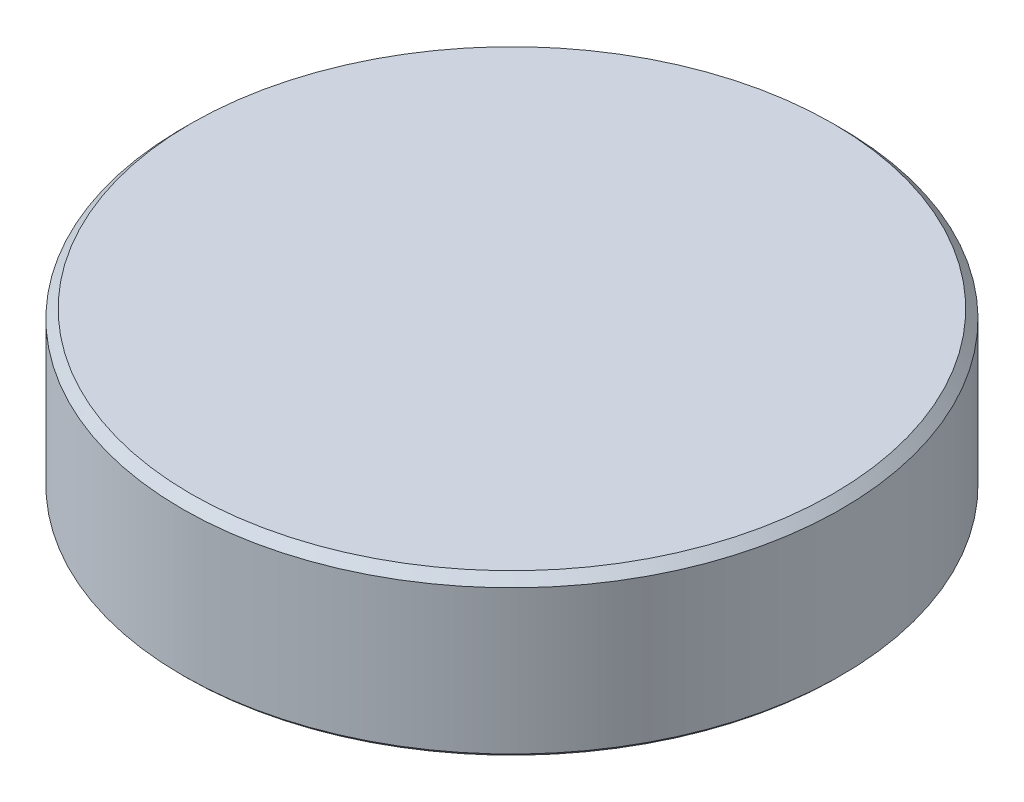
ISO-10303-21;
HEADER;
FILE_DESCRIPTION(('STEP AP214'),'2;1');
FILE_NAME('part.step','',(''),(''),'','','');
FILE_SCHEMA(('AUTOMOTIVE_DESIGN { 1 0 10303 214 1 1 1 1 }'));
ENDSEC;
DATA;
#1=APPLICATION_CONTEXT('core data for automotive mechanical design processes');
#2=APPLICATION_PROTOCOL_DEFINITION('international standard','automotive_design',2000,#1);
#3=PRODUCT_CONTEXT('',#1,'mechanical');
#4=PRODUCT('Part','Part','',(#3));
#5=PRODUCT_RELATED_PRODUCT_CATEGORY('part','',(#4));
#6=PRODUCT_DEFINITION_FORMATION('','',#4);
#7=PRODUCT_DEFINITION_CONTEXT('part definition',#1,'design');
#8=PRODUCT_DEFINITION('design','',#6,#7);
#9=PRODUCT_DEFINITION_SHAPE('','',#8);
#10=(LENGTH_UNIT() NAMED_UNIT(*) SI_UNIT(.MILLI.,.METRE.));
#11=(NAMED_UNIT(*) PLANE_ANGLE_UNIT() SI_UNIT($,.RADIAN.));
#12=(NAMED_UNIT(*) SI_UNIT($,.STERADIAN.) SOLID_ANGLE_UNIT());
#13=UNCERTAINTY_MEASURE_WITH_UNIT(LENGTH_MEASURE(1.E-05),#10,'distance_accuracy_value','');
#14=(GEOMETRIC_REPRESENTATION_CONTEXT(3) GLOBAL_UNCERTAINTY_ASSIGNED_CONTEXT((#13)) GLOBAL_UNIT_ASSIGNED_CONTEXT((#10,
#11,#12)) REPRESENTATION_CONTEXT('',''));
#15=CARTESIAN_POINT('',(0.,0.,0.));
#16=DIRECTION('',(0.,0.,1.));
#17=DIRECTION('',(1.,0.,0.));
#18=AXIS2_PLACEMENT_3D('',#15,#16,#17);
#19=CARTESIAN_POINT('',(0.,0.,0.));
#20=DIRECTION('',(0.,1.,0.));
#21=DIRECTION('',(0.,0.,1.));
#22=AXIS2_PLACEMENT_3D('',#19,#20,#21);
#23=PLANE('',#22);
#24=CARTESIAN_POINT('',(0.,0.,0.));
#25=DIRECTION('',(0.,1.,0.));
#26=DIRECTION('',(0.,0.,1.));
#27=AXIS2_PLACEMENT_3D('',#24,#25,#26);
#28=CIRCLE('',#27,36.4);
#29=CARTESIAN_POINT('',(0.,0.,36.4));
#30=VERTEX_POINT('',#29);
#31=EDGE_CURVE('E76',#30,#30,#28,.T.);
#32=ORIENTED_EDGE('',*,*,#31,.T.);
#33=EDGE_LOOP('',(#32));
#34=FACE_BOUND('',#33,.T.);
#35=CARTESIAN_POINT('',(0.,0.,0.));
#36=DIRECTION('',(0.,1.,0.));
#37=DIRECTION('',(0.,0.,1.));
#38=AXIS2_PLACEMENT_3D('',#35,#36,#37);
#39=CIRCLE('',#38,37.6);
#40=CARTESIAN_POINT('',(0.,0.,37.6));
#41=VERTEX_POINT('',#40);
#42=EDGE_CURVE('E79',#41,#41,#39,.F.);
#43=ORIENTED_EDGE('',*,*,#42,.T.);
#44=EDGE_LOOP('',(#43));
#45=FACE_BOUND('',#44,.T.);
#46=ADVANCED_FACE('F39',(#34,#45),#23,.F.);
#47=CARTESIAN_POINT('',(0.,16.,0.));
#48=DIRECTION('',(0.,-1.,0.));
#49=DIRECTION('',(0.,0.,-1.));
#50=AXIS2_PLACEMENT_3D('',#47,#48,#49);
#51=CYLINDRICAL_SURFACE('',#50,38.);
#52=CARTESIAN_POINT('',(0.,17.,0.));
#53=DIRECTION('',(0.,1.,0.));
#54=DIRECTION('',(0.,0.,1.));
#55=AXIS2_PLACEMENT_3D('',#52,#53,#54);
#56=CIRCLE('',#55,38.);
#57=CARTESIAN_POINT('',(0.,17.,38.));
#58=VERTEX_POINT('',#57);
#59=EDGE_CURVE('E10',#58,#58,#56,.F.);
#60=ORIENTED_EDGE('',*,*,#59,.T.);
#61=EDGE_LOOP('',(#60));
#62=FACE_BOUND('',#61,.T.);
#63=CARTESIAN_POINT('',(0.,0.399999999999998,0.));
#64=DIRECTION('',(0.,1.,0.));
#65=DIRECTION('',(0.,0.,1.));
#66=AXIS2_PLACEMENT_3D('',#63,#64,#65);
#67=CIRCLE('',#66,38.);
#68=CARTESIAN_POINT('',(0.,0.399999999999998,38.));
#69=VERTEX_POINT('',#68);
#70=EDGE_CURVE('E73',#69,#69,#67,.T.);
#71=ORIENTED_EDGE('',*,*,#70,.T.);
#72=EDGE_LOOP('',(#71));
#73=FACE_BOUND('',#72,.T.);
#74=ADVANCED_FACE('F112',(#62,#73),#51,.T.);
#75=CARTESIAN_POINT('',(0.,16.,0.));
#76=DIRECTION('',(0.,-1.,0.));
#77=DIRECTION('',(0.,0.,-1.));
#78=AXIS2_PLACEMENT_3D('',#75,#76,#77);
#79=CYLINDRICAL_SURFACE('',#78,36.);
#80=CARTESIAN_POINT('',(0.,15.6,0.));
#81=DIRECTION('',(0.,1.,0.));
#82=DIRECTION('',(0.,0.,1.));
#83=AXIS2_PLACEMENT_3D('',#80,#81,#82);
#84=CIRCLE('',#83,36.);
#85=CARTESIAN_POINT('',(0.,15.6,36.));
#86=VERTEX_POINT('',#85);
#87=EDGE_CURVE('E85',#86,#86,#84,.T.);
#88=ORIENTED_EDGE('',*,*,#87,.T.);
#89=EDGE_LOOP('',(#88));
#90=FACE_BOUND('',#89,.T.);
#91=CARTESIAN_POINT('',(0.,0.399999999999991,0.));
#92=DIRECTION('',(0.,1.,0.));
#93=DIRECTION('',(0.,0.,1.));
#94=AXIS2_PLACEMENT_3D('',#91,#92,#93);
#95=CIRCLE('',#94,36.);
#96=CARTESIAN_POINT('',(0.,0.399999999999991,36.));
#97=VERTEX_POINT('',#96);
#98=EDGE_CURVE('E88',#97,#97,#95,.F.);
#99=ORIENTED_EDGE('',*,*,#98,.T.);
#100=EDGE_LOOP('',(#99));
#101=FACE_BOUND('',#100,.T.);
#102=ADVANCED_FACE('F119',(#90,#101),#79,.F.);
#103=CARTESIAN_POINT('',(0.,16.,0.));
#104=DIRECTION('',(0.,1.,0.));
#105=DIRECTION('',(0.,0.,1.));
#106=AXIS2_PLACEMENT_3D('',#103,#104,#105);
#107=PLANE('',#106);
#108=CARTESIAN_POINT('',(0.,16.,0.));
#109=DIRECTION('',(0.,1.,0.));
#110=DIRECTION('',(0.,0.,1.));
#111=AXIS2_PLACEMENT_3D('',#108,#109,#110);
#112=CIRCLE('',#111,5.39999999999997);
#113=CARTESIAN_POINT('',(0.,16.,5.39999999999997));
#114=VERTEX_POINT('',#113);
#115=EDGE_CURVE('E63',#114,#114,#112,.T.);
#116=ORIENTED_EDGE('',*,*,#115,.T.);
#117=EDGE_LOOP('',(#116));
#118=FACE_BOUND('',#117,.T.);
#119=CARTESIAN_POINT('',(0.,16.,0.));
#120=DIRECTION('',(0.,1.,0.));
#121=DIRECTION('',(0.,0.,1.));
#122=AXIS2_PLACEMENT_3D('',#119,#120,#121);
#123=CIRCLE('',#122,35.6);
#124=CARTESIAN_POINT('',(0.,16.,35.6));
#125=VERTEX_POINT('',#124);
#126=EDGE_CURVE('E82',#125,#125,#123,.F.);
#127=ORIENTED_EDGE('',*,*,#126,.T.);
#128=EDGE_LOOP('',(#127));
#129=FACE_BOUND('',#128,.T.);
#130=ADVANCED_FACE('F206',(#118,#129),#107,.F.);
#131=CARTESIAN_POINT('',(0.,18.,0.));
#132=DIRECTION('',(0.,1.,0.));
#133=DIRECTION('',(0.,0.,1.));
#134=AXIS2_PLACEMENT_3D('',#131,#132,#133);
#135=PLANE('',#134);
#136=CARTESIAN_POINT('',(0.,18.,0.));
#137=DIRECTION('',(0.,1.,0.));
#138=DIRECTION('',(0.,0.,1.));
#139=AXIS2_PLACEMENT_3D('',#136,#137,#138);
#140=CIRCLE('',#139,37.);
#141=CARTESIAN_POINT('',(0.,18.,37.));
#142=VERTEX_POINT('',#141);
#143=EDGE_CURVE('E47',#142,#142,#140,.T.);
#144=ORIENTED_EDGE('',*,*,#143,.T.);
#145=EDGE_LOOP('',(#144));
#146=FACE_BOUND('',#145,.T.);
#147=ADVANCED_FACE('F133',(#146),#135,.T.);
#148=CARTESIAN_POINT('',(0.,15.6,0.));
#149=DIRECTION('',(0.,-1.,0.));
#150=DIRECTION('',(0.,0.,-1.));
#151=AXIS2_PLACEMENT_3D('',#148,#149,#150);
#152=CONICAL_SURFACE('',#151,36.,0.785398163397448);
#153=ORIENTED_EDGE('',*,*,#126,.F.);
#154=EDGE_LOOP('',(#153));
#155=FACE_BOUND('',#154,.T.);
#156=ORIENTED_EDGE('',*,*,#87,.F.);
#157=EDGE_LOOP('',(#156));
#158=FACE_BOUND('',#157,.T.);
#159=ADVANCED_FACE('F126',(#155,#158),#152,.F.);
#160=CARTESIAN_POINT('',(0.,0.,0.));
#161=DIRECTION('',(0.,-1.,0.));
#162=DIRECTION('',(0.,0.,-1.));
#163=AXIS2_PLACEMENT_3D('',#160,#161,#162);
#164=CONICAL_SURFACE('',#163,36.4,0.785398163397448);
#165=ORIENTED_EDGE('',*,*,#98,.F.);
#166=EDGE_LOOP('',(#165));
#167=FACE_BOUND('',#166,.T.);
#168=ORIENTED_EDGE('',*,*,#31,.F.);
#169=EDGE_LOOP('',(#168));
#170=FACE_BOUND('',#169,.T.);
#171=ADVANCED_FACE('F132',(#167,#170),#164,.F.);
#172=CARTESIAN_POINT('',(0.,0.399999999999998,0.));
#173=DIRECTION('',(0.,1.,0.));
#174=DIRECTION('',(0.,0.,1.));
#175=AXIS2_PLACEMENT_3D('',#172,#173,#174);
#176=CONICAL_SURFACE('',#175,38.,0.785398163397457);
#177=ORIENTED_EDGE('',*,*,#42,.F.);
#178=EDGE_LOOP('',(#177));
#179=FACE_BOUND('',#178,.T.);
#180=ORIENTED_EDGE('',*,*,#70,.F.);
#181=EDGE_LOOP('',(#180));
#182=FACE_BOUND('',#181,.T.);
#183=ADVANCED_FACE('F108',(#179,#182),#176,.T.);
#184=CARTESIAN_POINT('',(0.,14.,0.));
#185=DIRECTION('',(0.,1.,0.));
#186=DIRECTION('',(0.,0.,1.));
#187=AXIS2_PLACEMENT_3D('',#184,#185,#186);
#188=CYLINDRICAL_SURFACE('',#187,5.);
#189=CARTESIAN_POINT('',(0.,15.6,0.));
#190=DIRECTION('',(0.,1.,0.));
#191=DIRECTION('',(0.,0.,1.));
#192=AXIS2_PLACEMENT_3D('',#189,#190,#191);
#193=CIRCLE('',#192,5.);
#194=CARTESIAN_POINT('',(0.,15.6,5.));
#195=VERTEX_POINT('',#194);
#196=EDGE_CURVE('E66',#195,#195,#193,.F.);
#197=ORIENTED_EDGE('',*,*,#196,.T.);
#198=EDGE_LOOP('',(#197));
#199=FACE_BOUND('',#198,.T.);
#200=CARTESIAN_POINT('',(0.,14.4,0.));
#201=DIRECTION('',(0.,-1.,0.));
#202=DIRECTION('',(0.,0.,-1.));
#203=AXIS2_PLACEMENT_3D('',#200,#201,#202);
#204=CIRCLE('',#203,5.);
#205=CARTESIAN_POINT('',(0.,14.4,-5.));
#206=VERTEX_POINT('',#205);
#207=EDGE_CURVE('E69',#206,#206,#204,.F.);
#208=ORIENTED_EDGE('',*,*,#207,.T.);
#209=EDGE_LOOP('',(#208));
#210=FACE_BOUND('',#209,.T.);
#211=ADVANCED_FACE('F98',(#199,#210),#188,.T.);
#212=CARTESIAN_POINT('',(0.,14.,0.));
#213=DIRECTION('',(0.,-1.,0.));
#214=DIRECTION('',(0.,0.,-1.));
#215=AXIS2_PLACEMENT_3D('',#212,#213,#214);
#216=PLANE('',#215);
#217=CARTESIAN_POINT('',(0.,14.,0.));
#218=DIRECTION('',(0.,-1.,0.));
#219=DIRECTION('',(0.,0.,-1.));
#220=AXIS2_PLACEMENT_3D('',#217,#218,#219);
#221=CIRCLE('',#220,4.60000000000002);
#222=CARTESIAN_POINT('',(0.,14.,-4.60000000000002));
#223=VERTEX_POINT('',#222);
#224=EDGE_CURVE('E60',#223,#223,#221,.T.);
#225=ORIENTED_EDGE('',*,*,#224,.T.);
#226=EDGE_LOOP('',(#225));
#227=FACE_BOUND('',#226,.T.);
#228=CARTESIAN_POINT('',(0.,14.,0.));
#229=DIRECTION('',(0.,-1.,0.));
#230=DIRECTION('',(0.,0.,-1.));
#231=AXIS2_PLACEMENT_3D('',#228,#229,#230);
#232=CIRCLE('',#231,3.);
#233=CARTESIAN_POINT('',(0.,14.,-3.));
#234=VERTEX_POINT('',#233);
#235=EDGE_CURVE('E72',#234,#234,#232,.T.);
#236=ORIENTED_EDGE('',*,*,#235,.F.);
#237=EDGE_LOOP('',(#236));
#238=FACE_BOUND('',#237,.T.);
#239=ADVANCED_FACE('F96',(#227,#238),#216,.T.);
#240=CARTESIAN_POINT('',(0.,7.,0.));
#241=DIRECTION('',(0.,1.,0.));
#242=DIRECTION('',(0.,0.,1.));
#243=AXIS2_PLACEMENT_3D('',#240,#241,#242);
#244=CYLINDRICAL_SURFACE('',#243,3.);
#245=CARTESIAN_POINT('',(0.,7.40000000000002,0.));
#246=DIRECTION('',(0.,-1.,0.));
#247=DIRECTION('',(0.,0.,-1.));
#248=AXIS2_PLACEMENT_3D('',#245,#246,#247);
#249=CIRCLE('',#248,3.);
#250=CARTESIAN_POINT('',(0.,7.40000000000002,-3.));
#251=VERTEX_POINT('',#250);
#252=EDGE_CURVE('E51',#251,#251,#249,.F.);
#253=ORIENTED_EDGE('',*,*,#252,.T.);
#254=EDGE_LOOP('',(#253));
#255=FACE_BOUND('',#254,.T.);
#256=ORIENTED_EDGE('',*,*,#235,.T.);
#257=EDGE_LOOP('',(#256));
#258=FACE_BOUND('',#257,.T.);
#259=ADVANCED_FACE('F94',(#255,#258),#244,.T.);
#260=CARTESIAN_POINT('',(0.,7.,0.));
#261=DIRECTION('',(0.,-1.,0.));
#262=DIRECTION('',(0.,0.,-1.));
#263=AXIS2_PLACEMENT_3D('',#260,#261,#262);
#264=PLANE('',#263);
#265=CARTESIAN_POINT('',(0.,7.,0.));
#266=DIRECTION('',(0.,-1.,0.));
#267=DIRECTION('',(0.,0.,-1.));
#268=AXIS2_PLACEMENT_3D('',#265,#266,#267);
#269=CIRCLE('',#268,2.59999999999998);
#270=CARTESIAN_POINT('',(0.,7.,-2.59999999999998));
#271=VERTEX_POINT('',#270);
#272=EDGE_CURVE('E55',#271,#271,#269,.T.);
#273=ORIENTED_EDGE('',*,*,#272,.T.);
#274=EDGE_LOOP('',(#273));
#275=FACE_BOUND('',#274,.T.);
#276=ADVANCED_FACE('F105',(#275),#264,.T.);
#277=CARTESIAN_POINT('',(0.,15.6,0.));
#278=DIRECTION('',(0.,1.,0.));
#279=DIRECTION('',(0.,0.,1.));
#280=AXIS2_PLACEMENT_3D('',#277,#278,#279);
#281=CONICAL_SURFACE('',#280,5.,0.785398163397436);
#282=ORIENTED_EDGE('',*,*,#115,.F.);
#283=EDGE_LOOP('',(#282));
#284=FACE_BOUND('',#283,.T.);
#285=ORIENTED_EDGE('',*,*,#196,.F.);
#286=EDGE_LOOP('',(#285));
#287=FACE_BOUND('',#286,.T.);
#288=ADVANCED_FACE('F147',(#284,#287),#281,.T.);
#289=CARTESIAN_POINT('',(0.,14.,0.));
#290=DIRECTION('',(0.,1.,0.));
#291=DIRECTION('',(0.,0.,1.));
#292=AXIS2_PLACEMENT_3D('',#289,#290,#291);
#293=CONICAL_SURFACE('',#292,4.60000000000002,0.785398163397432);
#294=ORIENTED_EDGE('',*,*,#207,.F.);
#295=EDGE_LOOP('',(#294));
#296=FACE_BOUND('',#295,.T.);
#297=ORIENTED_EDGE('',*,*,#224,.F.);
#298=EDGE_LOOP('',(#297));
#299=FACE_BOUND('',#298,.T.);
#300=ADVANCED_FACE('F153',(#296,#299),#293,.T.);
#301=CARTESIAN_POINT('',(0.,7.,0.));
#302=DIRECTION('',(0.,1.,0.));
#303=DIRECTION('',(0.,0.,1.));
#304=AXIS2_PLACEMENT_3D('',#301,#302,#303);
#305=CONICAL_SURFACE('',#304,2.59999999999998,0.785398163397454);
#306=ORIENTED_EDGE('',*,*,#252,.F.);
#307=EDGE_LOOP('',(#306));
#308=FACE_BOUND('',#307,.T.);
#309=ORIENTED_EDGE('',*,*,#272,.F.);
#310=EDGE_LOOP('',(#309));
#311=FACE_BOUND('',#310,.T.);
#312=ADVANCED_FACE('F159',(#308,#311),#305,.T.);
#313=CARTESIAN_POINT('',(0.,18.,0.));
#314=DIRECTION('',(0.,-1.,0.));
#315=DIRECTION('',(0.,0.,-1.));
#316=AXIS2_PLACEMENT_3D('',#313,#314,#315);
#317=CONICAL_SURFACE('',#316,37.,0.785398163397445);
#318=ORIENTED_EDGE('',*,*,#59,.F.);
#319=EDGE_LOOP('',(#318));
#320=FACE_BOUND('',#319,.T.);
#321=ORIENTED_EDGE('',*,*,#143,.F.);
#322=EDGE_LOOP('',(#321));
#323=FACE_BOUND('',#322,.T.);
#324=ADVANCED_FACE('F42',(#320,#323),#317,.T.);
#325=CLOSED_SHELL('',(#46,#74,#102,#130,#147,#159,#171,#183,#211,#239,#259,#276,#288,#300,#312,#324));
#326=MANIFOLD_SOLID_BREP('B2',#325);
#327=ADVANCED_BREP_SHAPE_REPRESENTATION('',(#18,#326),#14);
#328=SHAPE_DEFINITION_REPRESENTATION(#9,#327);
ENDSEC;
END-ISO-10303-21;
